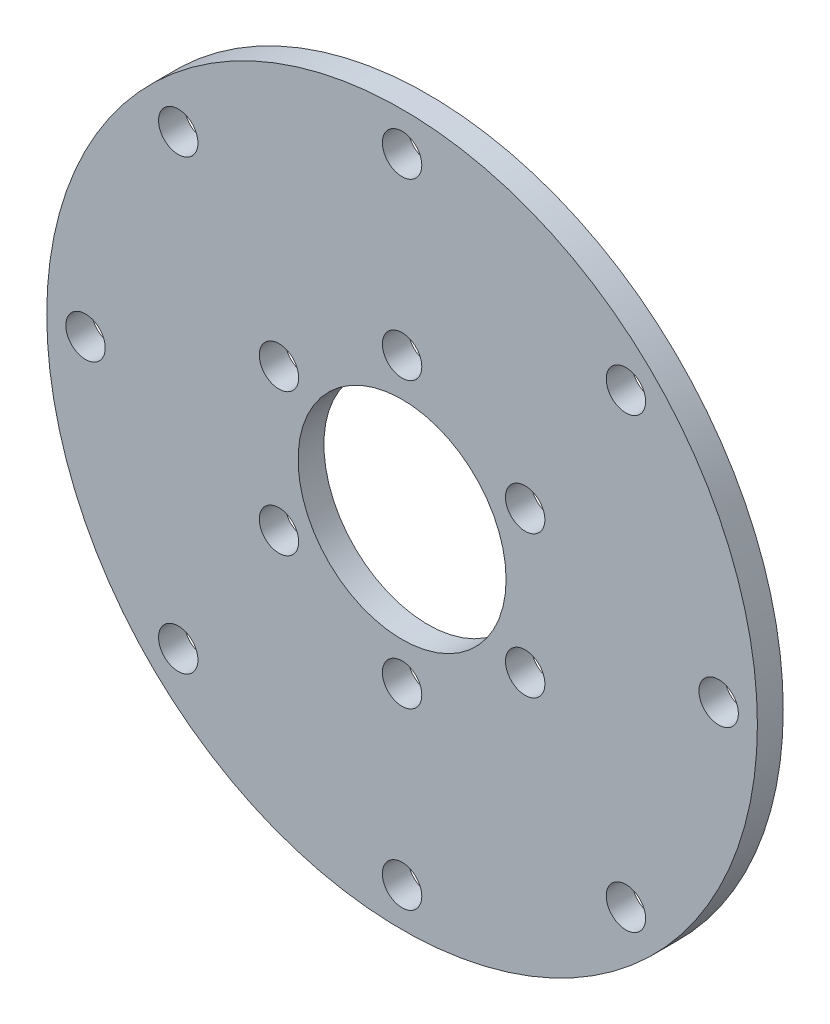
ISO-10303-21;
HEADER;
FILE_DESCRIPTION(('STEP AP214'),'2;1');
FILE_NAME('part.step','',(''),(''),'','','');
FILE_SCHEMA(('AUTOMOTIVE_DESIGN { 1 0 10303 214 1 1 1 1 }'));
ENDSEC;
DATA;
#1=APPLICATION_CONTEXT('core data for automotive mechanical design processes');
#2=APPLICATION_PROTOCOL_DEFINITION('international standard','automotive_design',2000,#1);
#3=PRODUCT_CONTEXT('',#1,'mechanical');
#4=PRODUCT('Part','Part','',(#3));
#5=PRODUCT_RELATED_PRODUCT_CATEGORY('part','',(#4));
#6=PRODUCT_DEFINITION_FORMATION('','',#4);
#7=PRODUCT_DEFINITION_CONTEXT('part definition',#1,'design');
#8=PRODUCT_DEFINITION('design','',#6,#7);
#9=PRODUCT_DEFINITION_SHAPE('','',#8);
#10=(LENGTH_UNIT() NAMED_UNIT(*) SI_UNIT(.MILLI.,.METRE.));
#11=(NAMED_UNIT(*) PLANE_ANGLE_UNIT() SI_UNIT($,.RADIAN.));
#12=(NAMED_UNIT(*) SI_UNIT($,.STERADIAN.) SOLID_ANGLE_UNIT());
#13=UNCERTAINTY_MEASURE_WITH_UNIT(LENGTH_MEASURE(1.E-05),#10,'distance_accuracy_value','');
#14=(GEOMETRIC_REPRESENTATION_CONTEXT(3) GLOBAL_UNCERTAINTY_ASSIGNED_CONTEXT((#13)) GLOBAL_UNIT_ASSIGNED_CONTEXT((#10,
#11,#12)) REPRESENTATION_CONTEXT('',''));
#15=CARTESIAN_POINT('',(0.,0.,0.));
#16=DIRECTION('',(0.,0.,1.));
#17=DIRECTION('',(1.,0.,0.));
#18=AXIS2_PLACEMENT_3D('',#15,#16,#17);
#19=CARTESIAN_POINT('',(0.,0.,2.));
#20=DIRECTION('',(0.,0.,1.));
#21=DIRECTION('',(1.,0.,0.));
#22=AXIS2_PLACEMENT_3D('',#19,#20,#21);
#23=PLANE('',#22);
#24=CARTESIAN_POINT('',(0.,24.5,2.));
#25=DIRECTION('',(0.,0.,1.));
#26=DIRECTION('',(1.,0.,0.));
#27=AXIS2_PLACEMENT_3D('',#24,#25,#26);
#28=CIRCLE('',#27,1.525);
#29=CARTESIAN_POINT('',(1.525,24.5,2.));
#30=VERTEX_POINT('',#29);
#31=EDGE_CURVE('E129',#30,#30,#28,.T.);
#32=ORIENTED_EDGE('',*,*,#31,.F.);
#33=EDGE_LOOP('',(#32));
#34=FACE_BOUND('',#33,.T.);
#35=CARTESIAN_POINT('',(17.3241161390707,17.3241161390701,2.));
#36=DIRECTION('',(0.,0.,1.));
#37=DIRECTION('',(1.,0.,0.));
#38=AXIS2_PLACEMENT_3D('',#35,#36,#37);
#39=CIRCLE('',#38,1.525);
#40=CARTESIAN_POINT('',(18.8491161390707,17.3241161390701,2.));
#41=VERTEX_POINT('',#40);
#42=EDGE_CURVE('E123',#41,#41,#39,.T.);
#43=ORIENTED_EDGE('',*,*,#42,.F.);
#44=EDGE_LOOP('',(#43));
#45=FACE_BOUND('',#44,.T.);
#46=CARTESIAN_POINT('',(24.5,-4.31946145518225E-13,2.));
#47=DIRECTION('',(0.,0.,1.));
#48=DIRECTION('',(1.,0.,0.));
#49=AXIS2_PLACEMENT_3D('',#46,#47,#48);
#50=CIRCLE('',#49,1.525);
#51=CARTESIAN_POINT('',(26.025,-4.31946145518225E-13,2.));
#52=VERTEX_POINT('',#51);
#53=EDGE_CURVE('E117',#52,#52,#50,.T.);
#54=ORIENTED_EDGE('',*,*,#53,.F.);
#55=EDGE_LOOP('',(#54));
#56=FACE_BOUND('',#55,.T.);
#57=CARTESIAN_POINT('',(17.3241161390701,-17.3241161390708,2.));
#58=DIRECTION('',(0.,0.,1.));
#59=DIRECTION('',(1.,0.,0.));
#60=AXIS2_PLACEMENT_3D('',#57,#58,#59);
#61=CIRCLE('',#60,1.525);
#62=CARTESIAN_POINT('',(18.8491161390701,-17.3241161390708,2.));
#63=VERTEX_POINT('',#62);
#64=EDGE_CURVE('E111',#63,#63,#61,.T.);
#65=ORIENTED_EDGE('',*,*,#64,.F.);
#66=EDGE_LOOP('',(#65));
#67=FACE_BOUND('',#66,.T.);
#68=CARTESIAN_POINT('',(-5.20417042793042E-13,-24.5,2.));
#69=DIRECTION('',(0.,0.,1.));
#70=DIRECTION('',(1.,0.,0.));
#71=AXIS2_PLACEMENT_3D('',#68,#69,#70);
#72=CIRCLE('',#71,1.525);
#73=CARTESIAN_POINT('',(1.52499999999948,-24.5,2.));
#74=VERTEX_POINT('',#73);
#75=EDGE_CURVE('E105',#74,#74,#72,.T.);
#76=ORIENTED_EDGE('',*,*,#75,.F.);
#77=EDGE_LOOP('',(#76));
#78=FACE_BOUND('',#77,.T.);
#79=CARTESIAN_POINT('',(-17.3241161390708,-17.32411613907,2.));
#80=DIRECTION('',(0.,0.,1.));
#81=DIRECTION('',(1.,0.,0.));
#82=AXIS2_PLACEMENT_3D('',#79,#80,#81);
#83=CIRCLE('',#82,1.525);
#84=CARTESIAN_POINT('',(-15.7991161390708,-17.32411613907,2.));
#85=VERTEX_POINT('',#84);
#86=EDGE_CURVE('E99',#85,#85,#83,.T.);
#87=ORIENTED_EDGE('',*,*,#86,.F.);
#88=EDGE_LOOP('',(#87));
#89=FACE_BOUND('',#88,.T.);
#90=CARTESIAN_POINT('',(-24.5,0.,2.));
#91=DIRECTION('',(0.,0.,1.));
#92=DIRECTION('',(1.,0.,0.));
#93=AXIS2_PLACEMENT_3D('',#90,#91,#92);
#94=CIRCLE('',#93,1.52499999999942);
#95=CARTESIAN_POINT('',(-22.9750000000006,0.,2.));
#96=VERTEX_POINT('',#95);
#97=EDGE_CURVE('E93',#96,#96,#94,.T.);
#98=ORIENTED_EDGE('',*,*,#97,.F.);
#99=EDGE_LOOP('',(#98));
#100=FACE_BOUND('',#99,.T.);
#101=CARTESIAN_POINT('',(-17.3241161390702,17.3241161390706,2.));
#102=DIRECTION('',(0.,0.,1.));
#103=DIRECTION('',(1.,0.,0.));
#104=AXIS2_PLACEMENT_3D('',#101,#102,#103);
#105=CIRCLE('',#104,1.525);
#106=CARTESIAN_POINT('',(-15.7991161390702,17.3241161390706,2.));
#107=VERTEX_POINT('',#106);
#108=EDGE_CURVE('E87',#107,#107,#105,.T.);
#109=ORIENTED_EDGE('',*,*,#108,.F.);
#110=EDGE_LOOP('',(#109));
#111=FACE_BOUND('',#110,.T.);
#112=CARTESIAN_POINT('',(0.,11.,2.));
#113=DIRECTION('',(0.,0.,1.));
#114=DIRECTION('',(1.,0.,0.));
#115=AXIS2_PLACEMENT_3D('',#112,#113,#114);
#116=CIRCLE('',#115,1.525);
#117=CARTESIAN_POINT('',(1.525,11.,2.));
#118=VERTEX_POINT('',#117);
#119=EDGE_CURVE('E76',#118,#118,#116,.T.);
#120=ORIENTED_EDGE('',*,*,#119,.F.);
#121=EDGE_LOOP('',(#120));
#122=FACE_BOUND('',#121,.T.);
#123=CARTESIAN_POINT('',(-9.52627944162883,5.49999999999999,2.));
#124=DIRECTION('',(0.,0.,1.));
#125=DIRECTION('',(1.,0.,0.));
#126=AXIS2_PLACEMENT_3D('',#123,#124,#125);
#127=CIRCLE('',#126,1.52499999999972);
#128=CARTESIAN_POINT('',(-8.00127944162911,5.49999999999999,2.));
#129=VERTEX_POINT('',#128);
#130=EDGE_CURVE('E77',#129,#129,#127,.T.);
#131=ORIENTED_EDGE('',*,*,#130,.F.);
#132=EDGE_LOOP('',(#131));
#133=FACE_BOUND('',#132,.T.);
#134=CARTESIAN_POINT('',(-9.52627944162895,-5.49999999999978,2.));
#135=DIRECTION('',(0.,0.,1.));
#136=DIRECTION('',(1.,0.,0.));
#137=AXIS2_PLACEMENT_3D('',#134,#135,#136);
#138=CIRCLE('',#137,1.525);
#139=CARTESIAN_POINT('',(-8.00127944162896,-5.49999999999978,2.));
#140=VERTEX_POINT('',#139);
#141=EDGE_CURVE('E51',#140,#140,#138,.T.);
#142=ORIENTED_EDGE('',*,*,#141,.F.);
#143=EDGE_LOOP('',(#142));
#144=FACE_BOUND('',#143,.T.);
#145=CARTESIAN_POINT('',(-2.29342389188534E-13,-11.,2.));
#146=DIRECTION('',(0.,0.,1.));
#147=DIRECTION('',(1.,0.,0.));
#148=AXIS2_PLACEMENT_3D('',#145,#146,#147);
#149=CIRCLE('',#148,1.525);
#150=CARTESIAN_POINT('',(1.52499999999977,-11.,2.));
#151=VERTEX_POINT('',#150);
#152=EDGE_CURVE('E58',#151,#151,#149,.T.);
#153=ORIENTED_EDGE('',*,*,#152,.F.);
#154=EDGE_LOOP('',(#153));
#155=FACE_BOUND('',#154,.T.);
#156=CARTESIAN_POINT('',(9.52627944162872,-5.50000000000018,2.));
#157=DIRECTION('',(0.,0.,1.));
#158=DIRECTION('',(1.,0.,0.));
#159=AXIS2_PLACEMENT_3D('',#156,#157,#158);
#160=CIRCLE('',#159,1.525);
#161=CARTESIAN_POINT('',(11.0512794416287,-5.50000000000018,2.));
#162=VERTEX_POINT('',#161);
#163=EDGE_CURVE('E64',#162,#162,#160,.T.);
#164=ORIENTED_EDGE('',*,*,#163,.F.);
#165=EDGE_LOOP('',(#164));
#166=FACE_BOUND('',#165,.T.);
#167=CARTESIAN_POINT('',(9.52627944162891,5.49999999999984,2.));
#168=DIRECTION('',(0.,0.,1.));
#169=DIRECTION('',(1.,0.,0.));
#170=AXIS2_PLACEMENT_3D('',#167,#168,#169);
#171=CIRCLE('',#170,1.525);
#172=CARTESIAN_POINT('',(11.0512794416289,5.49999999999984,2.));
#173=VERTEX_POINT('',#172);
#174=EDGE_CURVE('E70',#173,#173,#171,.T.);
#175=ORIENTED_EDGE('',*,*,#174,.F.);
#176=EDGE_LOOP('',(#175));
#177=FACE_BOUND('',#176,.T.);
#178=CARTESIAN_POINT('',(0.,0.,2.));
#179=DIRECTION('',(0.,0.,1.));
#180=DIRECTION('',(1.,0.,0.));
#181=AXIS2_PLACEMENT_3D('',#178,#179,#180);
#182=CIRCLE('',#181,27.5);
#183=CARTESIAN_POINT('',(27.5,0.,2.));
#184=VERTEX_POINT('',#183);
#185=EDGE_CURVE('E10',#184,#184,#182,.T.);
#186=ORIENTED_EDGE('',*,*,#185,.T.);
#187=EDGE_LOOP('',(#186));
#188=FACE_BOUND('',#187,.T.);
#189=CARTESIAN_POINT('',(0.,0.,2.));
#190=DIRECTION('',(0.,0.,1.));
#191=DIRECTION('',(1.,0.,0.));
#192=AXIS2_PLACEMENT_3D('',#189,#190,#191);
#193=CIRCLE('',#192,8.05);
#194=CARTESIAN_POINT('',(8.05,0.,2.));
#195=VERTEX_POINT('',#194);
#196=EDGE_CURVE('E43',#195,#195,#193,.T.);
#197=ORIENTED_EDGE('',*,*,#196,.F.);
#198=EDGE_LOOP('',(#197));
#199=FACE_BOUND('',#198,.T.);
#200=ADVANCED_FACE('F32',(#34,#45,#56,#67,#78,#89,#100,#111,#122,#133,#144,#155,#166,#177,#188,
#199),#23,.T.);
#201=CARTESIAN_POINT('',(0.,0.,0.));
#202=DIRECTION('',(0.,0.,1.));
#203=DIRECTION('',(1.,0.,0.));
#204=AXIS2_PLACEMENT_3D('',#201,#202,#203);
#205=PLANE('',#204);
#206=CARTESIAN_POINT('',(0.,24.5,0.));
#207=DIRECTION('',(0.,0.,1.));
#208=DIRECTION('',(1.,0.,0.));
#209=AXIS2_PLACEMENT_3D('',#206,#207,#208);
#210=CIRCLE('',#209,1.525);
#211=CARTESIAN_POINT('',(1.525,24.5,0.));
#212=VERTEX_POINT('',#211);
#213=EDGE_CURVE('E80',#212,#212,#210,.T.);
#214=ORIENTED_EDGE('',*,*,#213,.T.);
#215=EDGE_LOOP('',(#214));
#216=FACE_BOUND('',#215,.T.);
#217=CARTESIAN_POINT('',(17.3241161390707,17.3241161390701,0.));
#218=DIRECTION('',(0.,0.,1.));
#219=DIRECTION('',(1.,0.,0.));
#220=AXIS2_PLACEMENT_3D('',#217,#218,#219);
#221=CIRCLE('',#220,1.525);
#222=CARTESIAN_POINT('',(18.8491161390707,17.3241161390701,0.));
#223=VERTEX_POINT('',#222);
#224=EDGE_CURVE('E126',#223,#223,#221,.T.);
#225=ORIENTED_EDGE('',*,*,#224,.T.);
#226=EDGE_LOOP('',(#225));
#227=FACE_BOUND('',#226,.T.);
#228=CARTESIAN_POINT('',(24.5,-4.31946145518225E-13,0.));
#229=DIRECTION('',(0.,0.,1.));
#230=DIRECTION('',(1.,0.,0.));
#231=AXIS2_PLACEMENT_3D('',#228,#229,#230);
#232=CIRCLE('',#231,1.525);
#233=CARTESIAN_POINT('',(26.025,-4.31946145518225E-13,0.));
#234=VERTEX_POINT('',#233);
#235=EDGE_CURVE('E120',#234,#234,#232,.T.);
#236=ORIENTED_EDGE('',*,*,#235,.T.);
#237=EDGE_LOOP('',(#236));
#238=FACE_BOUND('',#237,.T.);
#239=CARTESIAN_POINT('',(17.3241161390701,-17.3241161390708,0.));
#240=DIRECTION('',(0.,0.,1.));
#241=DIRECTION('',(1.,0.,0.));
#242=AXIS2_PLACEMENT_3D('',#239,#240,#241);
#243=CIRCLE('',#242,1.525);
#244=CARTESIAN_POINT('',(18.8491161390701,-17.3241161390708,0.));
#245=VERTEX_POINT('',#244);
#246=EDGE_CURVE('E114',#245,#245,#243,.T.);
#247=ORIENTED_EDGE('',*,*,#246,.T.);
#248=EDGE_LOOP('',(#247));
#249=FACE_BOUND('',#248,.T.);
#250=CARTESIAN_POINT('',(-5.20417042793042E-13,-24.5,0.));
#251=DIRECTION('',(0.,0.,1.));
#252=DIRECTION('',(1.,0.,0.));
#253=AXIS2_PLACEMENT_3D('',#250,#251,#252);
#254=CIRCLE('',#253,1.525);
#255=CARTESIAN_POINT('',(1.52499999999948,-24.5,0.));
#256=VERTEX_POINT('',#255);
#257=EDGE_CURVE('E108',#256,#256,#254,.T.);
#258=ORIENTED_EDGE('',*,*,#257,.T.);
#259=EDGE_LOOP('',(#258));
#260=FACE_BOUND('',#259,.T.);
#261=CARTESIAN_POINT('',(-17.3241161390708,-17.32411613907,0.));
#262=DIRECTION('',(0.,0.,1.));
#263=DIRECTION('',(1.,0.,0.));
#264=AXIS2_PLACEMENT_3D('',#261,#262,#263);
#265=CIRCLE('',#264,1.525);
#266=CARTESIAN_POINT('',(-15.7991161390708,-17.32411613907,0.));
#267=VERTEX_POINT('',#266);
#268=EDGE_CURVE('E102',#267,#267,#265,.T.);
#269=ORIENTED_EDGE('',*,*,#268,.T.);
#270=EDGE_LOOP('',(#269));
#271=FACE_BOUND('',#270,.T.);
#272=CARTESIAN_POINT('',(-24.5,0.,0.));
#273=DIRECTION('',(0.,0.,1.));
#274=DIRECTION('',(1.,0.,0.));
#275=AXIS2_PLACEMENT_3D('',#272,#273,#274);
#276=CIRCLE('',#275,1.52499999999942);
#277=CARTESIAN_POINT('',(-22.9750000000006,0.,0.));
#278=VERTEX_POINT('',#277);
#279=EDGE_CURVE('E96',#278,#278,#276,.T.);
#280=ORIENTED_EDGE('',*,*,#279,.T.);
#281=EDGE_LOOP('',(#280));
#282=FACE_BOUND('',#281,.T.);
#283=CARTESIAN_POINT('',(-17.3241161390702,17.3241161390706,0.));
#284=DIRECTION('',(0.,0.,1.));
#285=DIRECTION('',(1.,0.,0.));
#286=AXIS2_PLACEMENT_3D('',#283,#284,#285);
#287=CIRCLE('',#286,1.525);
#288=CARTESIAN_POINT('',(-15.7991161390702,17.3241161390706,0.));
#289=VERTEX_POINT('',#288);
#290=EDGE_CURVE('E90',#289,#289,#287,.T.);
#291=ORIENTED_EDGE('',*,*,#290,.T.);
#292=EDGE_LOOP('',(#291));
#293=FACE_BOUND('',#292,.T.);
#294=CARTESIAN_POINT('',(0.,11.,0.));
#295=DIRECTION('',(0.,0.,1.));
#296=DIRECTION('',(1.,0.,0.));
#297=AXIS2_PLACEMENT_3D('',#294,#295,#296);
#298=CIRCLE('',#297,1.525);
#299=CARTESIAN_POINT('',(1.525,11.,0.));
#300=VERTEX_POINT('',#299);
#301=EDGE_CURVE('E48',#300,#300,#298,.T.);
#302=ORIENTED_EDGE('',*,*,#301,.T.);
#303=EDGE_LOOP('',(#302));
#304=FACE_BOUND('',#303,.T.);
#305=CARTESIAN_POINT('',(-9.52627944162883,5.49999999999999,0.));
#306=DIRECTION('',(0.,0.,1.));
#307=DIRECTION('',(1.,0.,0.));
#308=AXIS2_PLACEMENT_3D('',#305,#306,#307);
#309=CIRCLE('',#308,1.52499999999972);
#310=CARTESIAN_POINT('',(-8.00127944162911,5.49999999999999,0.));
#311=VERTEX_POINT('',#310);
#312=EDGE_CURVE('E55',#311,#311,#309,.T.);
#313=ORIENTED_EDGE('',*,*,#312,.T.);
#314=EDGE_LOOP('',(#313));
#315=FACE_BOUND('',#314,.T.);
#316=CARTESIAN_POINT('',(-9.52627944162895,-5.49999999999978,0.));
#317=DIRECTION('',(0.,0.,1.));
#318=DIRECTION('',(1.,0.,0.));
#319=AXIS2_PLACEMENT_3D('',#316,#317,#318);
#320=CIRCLE('',#319,1.525);
#321=CARTESIAN_POINT('',(-8.00127944162896,-5.49999999999978,0.));
#322=VERTEX_POINT('',#321);
#323=EDGE_CURVE('E54',#322,#322,#320,.T.);
#324=ORIENTED_EDGE('',*,*,#323,.T.);
#325=EDGE_LOOP('',(#324));
#326=FACE_BOUND('',#325,.T.);
#327=CARTESIAN_POINT('',(-2.29342389188534E-13,-11.,0.));
#328=DIRECTION('',(0.,0.,1.));
#329=DIRECTION('',(1.,0.,0.));
#330=AXIS2_PLACEMENT_3D('',#327,#328,#329);
#331=CIRCLE('',#330,1.525);
#332=CARTESIAN_POINT('',(1.52499999999977,-11.,0.));
#333=VERTEX_POINT('',#332);
#334=EDGE_CURVE('E61',#333,#333,#331,.T.);
#335=ORIENTED_EDGE('',*,*,#334,.T.);
#336=EDGE_LOOP('',(#335));
#337=FACE_BOUND('',#336,.T.);
#338=CARTESIAN_POINT('',(9.52627944162872,-5.50000000000018,0.));
#339=DIRECTION('',(0.,0.,1.));
#340=DIRECTION('',(1.,0.,0.));
#341=AXIS2_PLACEMENT_3D('',#338,#339,#340);
#342=CIRCLE('',#341,1.525);
#343=CARTESIAN_POINT('',(11.0512794416287,-5.50000000000018,0.));
#344=VERTEX_POINT('',#343);
#345=EDGE_CURVE('E67',#344,#344,#342,.T.);
#346=ORIENTED_EDGE('',*,*,#345,.T.);
#347=EDGE_LOOP('',(#346));
#348=FACE_BOUND('',#347,.T.);
#349=CARTESIAN_POINT('',(9.52627944162891,5.49999999999984,0.));
#350=DIRECTION('',(0.,0.,1.));
#351=DIRECTION('',(1.,0.,0.));
#352=AXIS2_PLACEMENT_3D('',#349,#350,#351);
#353=CIRCLE('',#352,1.525);
#354=CARTESIAN_POINT('',(11.0512794416289,5.49999999999984,0.));
#355=VERTEX_POINT('',#354);
#356=EDGE_CURVE('E73',#355,#355,#353,.T.);
#357=ORIENTED_EDGE('',*,*,#356,.T.);
#358=EDGE_LOOP('',(#357));
#359=FACE_BOUND('',#358,.T.);
#360=CARTESIAN_POINT('',(0.,0.,0.));
#361=DIRECTION('',(0.,0.,1.));
#362=DIRECTION('',(1.,0.,0.));
#363=AXIS2_PLACEMENT_3D('',#360,#361,#362);
#364=CIRCLE('',#363,27.5);
#365=CARTESIAN_POINT('',(27.5,0.,0.));
#366=VERTEX_POINT('',#365);
#367=EDGE_CURVE('E36',#366,#366,#364,.T.);
#368=ORIENTED_EDGE('',*,*,#367,.F.);
#369=EDGE_LOOP('',(#368));
#370=FACE_BOUND('',#369,.T.);
#371=CARTESIAN_POINT('',(0.,0.,0.));
#372=DIRECTION('',(0.,0.,1.));
#373=DIRECTION('',(1.,0.,0.));
#374=AXIS2_PLACEMENT_3D('',#371,#372,#373);
#375=CIRCLE('',#374,8.05);
#376=CARTESIAN_POINT('',(8.05,0.,0.));
#377=VERTEX_POINT('',#376);
#378=EDGE_CURVE('E45',#377,#377,#375,.T.);
#379=ORIENTED_EDGE('',*,*,#378,.T.);
#380=EDGE_LOOP('',(#379));
#381=FACE_BOUND('',#380,.T.);
#382=ADVANCED_FACE('F135',(#216,#227,#238,#249,#260,#271,#282,#293,#304,#315,#326,#337,#348,
#359,#370,#381),#205,.F.);
#383=CARTESIAN_POINT('',(0.,0.,2.));
#384=DIRECTION('',(0.,0.,-1.));
#385=DIRECTION('',(-1.,0.,0.));
#386=AXIS2_PLACEMENT_3D('',#383,#384,#385);
#387=CYLINDRICAL_SURFACE('',#386,27.5);
#388=ORIENTED_EDGE('',*,*,#185,.F.);
#389=EDGE_LOOP('',(#388));
#390=FACE_BOUND('',#389,.T.);
#391=ORIENTED_EDGE('',*,*,#367,.T.);
#392=EDGE_LOOP('',(#391));
#393=FACE_BOUND('',#392,.T.);
#394=ADVANCED_FACE('F34',(#390,#393),#387,.T.);
#395=CARTESIAN_POINT('',(0.,0.,2.));
#396=DIRECTION('',(0.,0.,-1.));
#397=DIRECTION('',(-1.,0.,0.));
#398=AXIS2_PLACEMENT_3D('',#395,#396,#397);
#399=CYLINDRICAL_SURFACE('',#398,8.05);
#400=ORIENTED_EDGE('',*,*,#196,.T.);
#401=EDGE_LOOP('',(#400));
#402=FACE_BOUND('',#401,.T.);
#403=ORIENTED_EDGE('',*,*,#378,.F.);
#404=EDGE_LOOP('',(#403));
#405=FACE_BOUND('',#404,.T.);
#406=ADVANCED_FACE('F176',(#402,#405),#399,.F.);
#407=CARTESIAN_POINT('',(9.52627944162891,5.49999999999984,0.));
#408=DIRECTION('',(0.,0.,1.));
#409=DIRECTION('',(1.,0.,0.));
#410=AXIS2_PLACEMENT_3D('',#407,#408,#409);
#411=CYLINDRICAL_SURFACE('',#410,1.525);
#412=ORIENTED_EDGE('',*,*,#356,.F.);
#413=EDGE_LOOP('',(#412));
#414=FACE_BOUND('',#413,.T.);
#415=ORIENTED_EDGE('',*,*,#174,.T.);
#416=EDGE_LOOP('',(#415));
#417=FACE_BOUND('',#416,.T.);
#418=ADVANCED_FACE('F179',(#414,#417),#411,.F.);
#419=CARTESIAN_POINT('',(9.52627944162872,-5.50000000000018,0.));
#420=DIRECTION('',(0.,0.,1.));
#421=DIRECTION('',(1.,0.,0.));
#422=AXIS2_PLACEMENT_3D('',#419,#420,#421);
#423=CYLINDRICAL_SURFACE('',#422,1.525);
#424=ORIENTED_EDGE('',*,*,#345,.F.);
#425=EDGE_LOOP('',(#424));
#426=FACE_BOUND('',#425,.T.);
#427=ORIENTED_EDGE('',*,*,#163,.T.);
#428=EDGE_LOOP('',(#427));
#429=FACE_BOUND('',#428,.T.);
#430=ADVANCED_FACE('F197',(#426,#429),#423,.F.);
#431=CARTESIAN_POINT('',(-2.29342389188534E-13,-11.,0.));
#432=DIRECTION('',(0.,0.,1.));
#433=DIRECTION('',(1.,0.,0.));
#434=AXIS2_PLACEMENT_3D('',#431,#432,#433);
#435=CYLINDRICAL_SURFACE('',#434,1.525);
#436=ORIENTED_EDGE('',*,*,#334,.F.);
#437=EDGE_LOOP('',(#436));
#438=FACE_BOUND('',#437,.T.);
#439=ORIENTED_EDGE('',*,*,#152,.T.);
#440=EDGE_LOOP('',(#439));
#441=FACE_BOUND('',#440,.T.);
#442=ADVANCED_FACE('F193',(#438,#441),#435,.F.);
#443=CARTESIAN_POINT('',(-9.52627944162895,-5.49999999999978,0.));
#444=DIRECTION('',(0.,0.,1.));
#445=DIRECTION('',(1.,0.,0.));
#446=AXIS2_PLACEMENT_3D('',#443,#444,#445);
#447=CYLINDRICAL_SURFACE('',#446,1.525);
#448=ORIENTED_EDGE('',*,*,#323,.F.);
#449=EDGE_LOOP('',(#448));
#450=FACE_BOUND('',#449,.T.);
#451=ORIENTED_EDGE('',*,*,#141,.T.);
#452=EDGE_LOOP('',(#451));
#453=FACE_BOUND('',#452,.T.);
#454=ADVANCED_FACE('F189',(#450,#453),#447,.F.);
#455=CARTESIAN_POINT('',(-9.52627944162883,5.49999999999999,0.));
#456=DIRECTION('',(0.,0.,1.));
#457=DIRECTION('',(1.,0.,0.));
#458=AXIS2_PLACEMENT_3D('',#455,#456,#457);
#459=CYLINDRICAL_SURFACE('',#458,1.52499999999972);
#460=ORIENTED_EDGE('',*,*,#312,.F.);
#461=EDGE_LOOP('',(#460));
#462=FACE_BOUND('',#461,.T.);
#463=ORIENTED_EDGE('',*,*,#130,.T.);
#464=EDGE_LOOP('',(#463));
#465=FACE_BOUND('',#464,.T.);
#466=ADVANCED_FACE('F192',(#462,#465),#459,.F.);
#467=CARTESIAN_POINT('',(0.,11.,0.));
#468=DIRECTION('',(0.,0.,1.));
#469=DIRECTION('',(1.,0.,0.));
#470=AXIS2_PLACEMENT_3D('',#467,#468,#469);
#471=CYLINDRICAL_SURFACE('',#470,1.525);
#472=ORIENTED_EDGE('',*,*,#301,.F.);
#473=EDGE_LOOP('',(#472));
#474=FACE_BOUND('',#473,.T.);
#475=ORIENTED_EDGE('',*,*,#119,.T.);
#476=EDGE_LOOP('',(#475));
#477=FACE_BOUND('',#476,.T.);
#478=ADVANCED_FACE('F207',(#474,#477),#471,.F.);
#479=CARTESIAN_POINT('',(-17.3241161390702,17.3241161390706,0.));
#480=DIRECTION('',(0.,0.,1.));
#481=DIRECTION('',(1.,0.,0.));
#482=AXIS2_PLACEMENT_3D('',#479,#480,#481);
#483=CYLINDRICAL_SURFACE('',#482,1.525);
#484=ORIENTED_EDGE('',*,*,#290,.F.);
#485=EDGE_LOOP('',(#484));
#486=FACE_BOUND('',#485,.T.);
#487=ORIENTED_EDGE('',*,*,#108,.T.);
#488=EDGE_LOOP('',(#487));
#489=FACE_BOUND('',#488,.T.);
#490=ADVANCED_FACE('F211',(#486,#489),#483,.F.);
#491=CARTESIAN_POINT('',(-24.5,0.,0.));
#492=DIRECTION('',(0.,0.,1.));
#493=DIRECTION('',(1.,0.,0.));
#494=AXIS2_PLACEMENT_3D('',#491,#492,#493);
#495=CYLINDRICAL_SURFACE('',#494,1.52499999999942);
#496=ORIENTED_EDGE('',*,*,#279,.F.);
#497=EDGE_LOOP('',(#496));
#498=FACE_BOUND('',#497,.T.);
#499=ORIENTED_EDGE('',*,*,#97,.T.);
#500=EDGE_LOOP('',(#499));
#501=FACE_BOUND('',#500,.T.);
#502=ADVANCED_FACE('F215',(#498,#501),#495,.F.);
#503=CARTESIAN_POINT('',(-17.3241161390708,-17.32411613907,0.));
#504=DIRECTION('',(0.,0.,1.));
#505=DIRECTION('',(1.,0.,0.));
#506=AXIS2_PLACEMENT_3D('',#503,#504,#505);
#507=CYLINDRICAL_SURFACE('',#506,1.525);
#508=ORIENTED_EDGE('',*,*,#268,.F.);
#509=EDGE_LOOP('',(#508));
#510=FACE_BOUND('',#509,.T.);
#511=ORIENTED_EDGE('',*,*,#86,.T.);
#512=EDGE_LOOP('',(#511));
#513=FACE_BOUND('',#512,.T.);
#514=ADVANCED_FACE('F219',(#510,#513),#507,.F.);
#515=CARTESIAN_POINT('',(-5.20417042793042E-13,-24.5,0.));
#516=DIRECTION('',(0.,0.,1.));
#517=DIRECTION('',(1.,0.,0.));
#518=AXIS2_PLACEMENT_3D('',#515,#516,#517);
#519=CYLINDRICAL_SURFACE('',#518,1.525);
#520=ORIENTED_EDGE('',*,*,#257,.F.);
#521=EDGE_LOOP('',(#520));
#522=FACE_BOUND('',#521,.T.);
#523=ORIENTED_EDGE('',*,*,#75,.T.);
#524=EDGE_LOOP('',(#523));
#525=FACE_BOUND('',#524,.T.);
#526=ADVANCED_FACE('F223',(#522,#525),#519,.F.);
#527=CARTESIAN_POINT('',(17.3241161390701,-17.3241161390708,0.));
#528=DIRECTION('',(0.,0.,1.));
#529=DIRECTION('',(1.,0.,0.));
#530=AXIS2_PLACEMENT_3D('',#527,#528,#529);
#531=CYLINDRICAL_SURFACE('',#530,1.525);
#532=ORIENTED_EDGE('',*,*,#246,.F.);
#533=EDGE_LOOP('',(#532));
#534=FACE_BOUND('',#533,.T.);
#535=ORIENTED_EDGE('',*,*,#64,.T.);
#536=EDGE_LOOP('',(#535));
#537=FACE_BOUND('',#536,.T.);
#538=ADVANCED_FACE('F227',(#534,#537),#531,.F.);
#539=CARTESIAN_POINT('',(24.5,-4.31946145518225E-13,0.));
#540=DIRECTION('',(0.,0.,1.));
#541=DIRECTION('',(1.,0.,0.));
#542=AXIS2_PLACEMENT_3D('',#539,#540,#541);
#543=CYLINDRICAL_SURFACE('',#542,1.525);
#544=ORIENTED_EDGE('',*,*,#235,.F.);
#545=EDGE_LOOP('',(#544));
#546=FACE_BOUND('',#545,.T.);
#547=ORIENTED_EDGE('',*,*,#53,.T.);
#548=EDGE_LOOP('',(#547));
#549=FACE_BOUND('',#548,.T.);
#550=ADVANCED_FACE('F231',(#546,#549),#543,.F.);
#551=CARTESIAN_POINT('',(17.3241161390707,17.3241161390701,0.));
#552=DIRECTION('',(0.,0.,1.));
#553=DIRECTION('',(1.,0.,0.));
#554=AXIS2_PLACEMENT_3D('',#551,#552,#553);
#555=CYLINDRICAL_SURFACE('',#554,1.525);
#556=ORIENTED_EDGE('',*,*,#224,.F.);
#557=EDGE_LOOP('',(#556));
#558=FACE_BOUND('',#557,.T.);
#559=ORIENTED_EDGE('',*,*,#42,.T.);
#560=EDGE_LOOP('',(#559));
#561=FACE_BOUND('',#560,.T.);
#562=ADVANCED_FACE('F141',(#558,#561),#555,.F.);
#563=CARTESIAN_POINT('',(0.,24.5,0.));
#564=DIRECTION('',(0.,0.,1.));
#565=DIRECTION('',(1.,0.,0.));
#566=AXIS2_PLACEMENT_3D('',#563,#564,#565);
#567=CYLINDRICAL_SURFACE('',#566,1.525);
#568=ORIENTED_EDGE('',*,*,#213,.F.);
#569=EDGE_LOOP('',(#568));
#570=FACE_BOUND('',#569,.T.);
#571=ORIENTED_EDGE('',*,*,#31,.T.);
#572=EDGE_LOOP('',(#571));
#573=FACE_BOUND('',#572,.T.);
#574=ADVANCED_FACE('F138',(#570,#573),#567,.F.);
#575=CLOSED_SHELL('',(#200,#382,#394,#406,#418,#430,#442,#454,#466,#478,#490,#502,#514,#526,
#538,#550,#562,#574));
#576=MANIFOLD_SOLID_BREP('B2',#575);
#577=ADVANCED_BREP_SHAPE_REPRESENTATION('',(#18,#576),#14);
#578=SHAPE_DEFINITION_REPRESENTATION(#9,#577);
ENDSEC;
END-ISO-10303-21;
